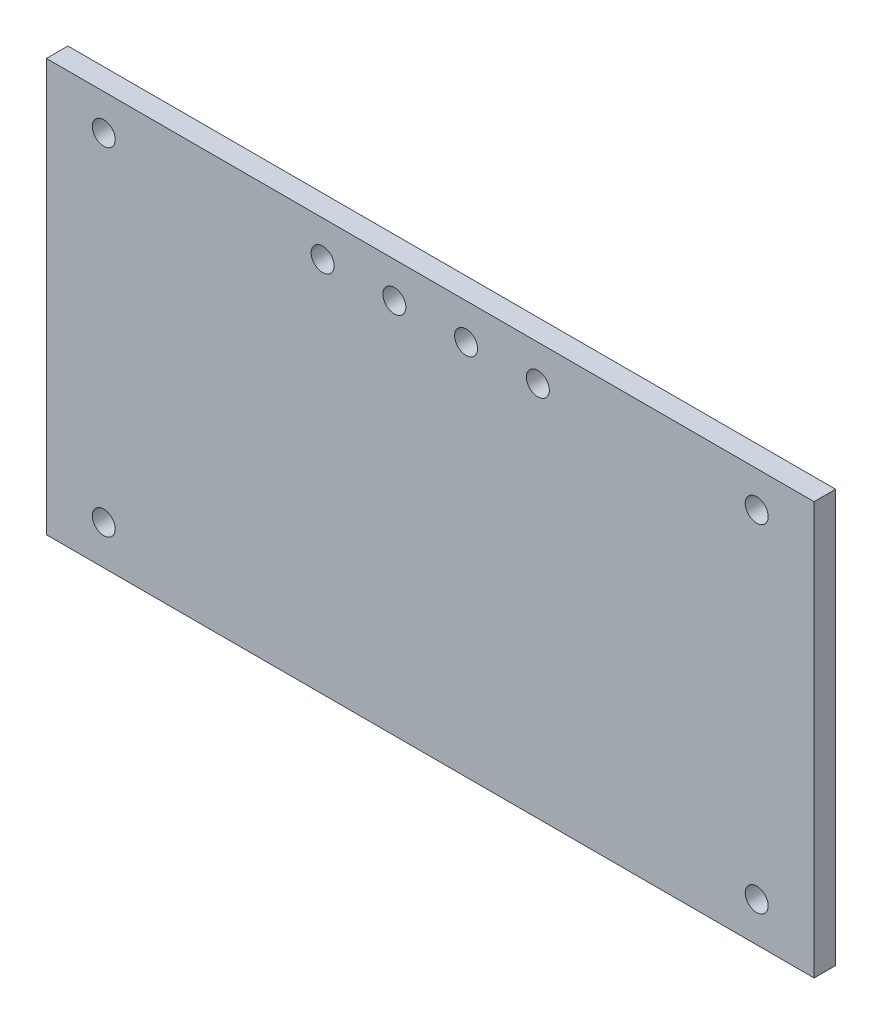
ISO-10303-21;
HEADER;
FILE_DESCRIPTION(('STEP AP214'),'2;1');
FILE_NAME('part.step','',(''),(''),'','','');
FILE_SCHEMA(('AUTOMOTIVE_DESIGN { 1 0 10303 214 1 1 1 1 }'));
ENDSEC;
DATA;
#1=APPLICATION_CONTEXT('core data for automotive mechanical design processes');
#2=APPLICATION_PROTOCOL_DEFINITION('international standard','automotive_design',2000,#1);
#3=PRODUCT_CONTEXT('',#1,'mechanical');
#4=PRODUCT('Part','Part','',(#3));
#5=PRODUCT_RELATED_PRODUCT_CATEGORY('part','',(#4));
#6=PRODUCT_DEFINITION_FORMATION('','',#4);
#7=PRODUCT_DEFINITION_CONTEXT('part definition',#1,'design');
#8=PRODUCT_DEFINITION('design','',#6,#7);
#9=PRODUCT_DEFINITION_SHAPE('','',#8);
#10=(LENGTH_UNIT() NAMED_UNIT(*) SI_UNIT(.MILLI.,.METRE.));
#11=(NAMED_UNIT(*) PLANE_ANGLE_UNIT() SI_UNIT($,.RADIAN.));
#12=(NAMED_UNIT(*) SI_UNIT($,.STERADIAN.) SOLID_ANGLE_UNIT());
#13=UNCERTAINTY_MEASURE_WITH_UNIT(LENGTH_MEASURE(1.E-05),#10,'distance_accuracy_value','');
#14=(GEOMETRIC_REPRESENTATION_CONTEXT(3) GLOBAL_UNCERTAINTY_ASSIGNED_CONTEXT((#13)) GLOBAL_UNIT_ASSIGNED_CONTEXT((#10,
#11,#12)) REPRESENTATION_CONTEXT('',''));
#15=CARTESIAN_POINT('',(0.,0.,0.));
#16=DIRECTION('',(0.,0.,1.));
#17=DIRECTION('',(1.,0.,0.));
#18=AXIS2_PLACEMENT_3D('',#15,#16,#17);
#19=CARTESIAN_POINT('',(0.,0.,3.));
#20=DIRECTION('',(0.,0.,1.));
#21=DIRECTION('',(1.,0.,0.));
#22=AXIS2_PLACEMENT_3D('',#19,#20,#21);
#23=PLANE('',#22);
#24=CARTESIAN_POINT('',(34.5759894264582,26.8307174887892,3.));
#25=DIRECTION('',(0.,0.,1.));
#26=DIRECTION('',(1.,0.,0.));
#27=AXIS2_PLACEMENT_3D('',#24,#25,#26);
#28=CIRCLE('',#27,1.6);
#29=CARTESIAN_POINT('',(36.1759894264582,26.8307174887892,3.));
#30=VERTEX_POINT('',#29);
#31=EDGE_CURVE('E178',#30,#30,#28,.T.);
#32=ORIENTED_EDGE('',*,*,#31,.F.);
#33=EDGE_LOOP('',(#32));
#34=FACE_BOUND('',#33,.T.);
#35=CARTESIAN_POINT('',(14.5759894264582,26.8307174887892,3.));
#36=DIRECTION('',(0.,0.,1.));
#37=DIRECTION('',(1.,0.,0.));
#38=AXIS2_PLACEMENT_3D('',#35,#36,#37);
#39=CIRCLE('',#38,1.6);
#40=CARTESIAN_POINT('',(16.1759894264582,26.8307174887892,3.));
#41=VERTEX_POINT('',#40);
#42=EDGE_CURVE('E162',#41,#41,#39,.T.);
#43=ORIENTED_EDGE('',*,*,#42,.F.);
#44=EDGE_LOOP('',(#43));
#45=FACE_BOUND('',#44,.T.);
#46=CARTESIAN_POINT('',(75.0759894264582,-20.1692825112108,3.));
#47=DIRECTION('',(0.,0.,1.));
#48=DIRECTION('',(1.,0.,0.));
#49=AXIS2_PLACEMENT_3D('',#46,#47,#48);
#50=CIRCLE('',#49,1.6);
#51=CARTESIAN_POINT('',(76.6759894264582,-20.1692825112108,3.));
#52=VERTEX_POINT('',#51);
#53=EDGE_CURVE('E146',#52,#52,#50,.T.);
#54=ORIENTED_EDGE('',*,*,#53,.F.);
#55=EDGE_LOOP('',(#54));
#56=FACE_BOUND('',#55,.T.);
#57=CARTESIAN_POINT('',(-15.9240105735418,26.8307174887892,3.));
#58=DIRECTION('',(0.,0.,1.));
#59=DIRECTION('',(1.,0.,0.));
#60=AXIS2_PLACEMENT_3D('',#57,#58,#59);
#61=CIRCLE('',#60,1.6);
#62=CARTESIAN_POINT('',(-14.3240105735418,26.8307174887892,3.));
#63=VERTEX_POINT('',#62);
#64=EDGE_CURVE('E116',#63,#63,#61,.T.);
#65=ORIENTED_EDGE('',*,*,#64,.F.);
#66=EDGE_LOOP('',(#65));
#67=FACE_BOUND('',#66,.T.);
#68=DIRECTION('',(0.,-1.,0.));
#69=VECTOR('',#68,1.);
#70=CARTESIAN_POINT('',(-23.9240105735418,31.8307174887892,3.));
#71=LINE('',#70,#69);
#72=CARTESIAN_POINT('',(-23.9240105735418,31.8307174887892,3.));
#73=VERTEX_POINT('',#72);
#74=CARTESIAN_POINT('',(-23.9240105735418,-25.6649428904323,3.));
#75=VERTEX_POINT('',#74);
#76=EDGE_CURVE('E96',#73,#75,#71,.T.);
#77=ORIENTED_EDGE('',*,*,#76,.T.);
#78=DIRECTION('',(1.,0.,0.));
#79=VECTOR('',#78,1.);
#80=CARTESIAN_POINT('',(-23.9240105735418,-25.6649428904323,3.));
#81=LINE('',#80,#79);
#82=CARTESIAN_POINT('',(83.0759894264582,-25.6649428904323,3.));
#83=VERTEX_POINT('',#82);
#84=EDGE_CURVE('E91',#75,#83,#81,.T.);
#85=ORIENTED_EDGE('',*,*,#84,.T.);
#86=DIRECTION('',(0.,1.,0.));
#87=VECTOR('',#86,1.);
#88=CARTESIAN_POINT('',(83.0759894264582,31.8307174887893,3.));
#89=LINE('',#88,#87);
#90=CARTESIAN_POINT('',(83.0759894264582,31.8307174887893,3.));
#91=VERTEX_POINT('',#90);
#92=EDGE_CURVE('E94',#83,#91,#89,.T.);
#93=ORIENTED_EDGE('',*,*,#92,.T.);
#94=DIRECTION('',(-1.,0.,0.));
#95=VECTOR('',#94,1.);
#96=CARTESIAN_POINT('',(-23.9240105735418,31.8307174887892,3.));
#97=LINE('',#96,#95);
#98=EDGE_CURVE('E61',#91,#73,#97,.T.);
#99=ORIENTED_EDGE('',*,*,#98,.T.);
#100=EDGE_LOOP('',(#77,#85,#93,#99));
#101=FACE_BOUND('',#100,.T.);
#102=CARTESIAN_POINT('',(-15.9240105735418,-20.1692825112108,3.));
#103=DIRECTION('',(0.,0.,1.));
#104=DIRECTION('',(1.,0.,0.));
#105=AXIS2_PLACEMENT_3D('',#102,#103,#104);
#106=CIRCLE('',#105,1.6);
#107=CARTESIAN_POINT('',(-14.3240105735418,-20.1692825112108,3.));
#108=VERTEX_POINT('',#107);
#109=EDGE_CURVE('E138',#108,#108,#106,.T.);
#110=ORIENTED_EDGE('',*,*,#109,.F.);
#111=EDGE_LOOP('',(#110));
#112=FACE_BOUND('',#111,.T.);
#113=CARTESIAN_POINT('',(75.0759894264582,26.8307174887893,3.));
#114=DIRECTION('',(0.,0.,1.));
#115=DIRECTION('',(1.,0.,0.));
#116=AXIS2_PLACEMENT_3D('',#113,#114,#115);
#117=CIRCLE('',#116,1.6);
#118=CARTESIAN_POINT('',(76.6759894264582,26.8307174887893,3.));
#119=VERTEX_POINT('',#118);
#120=EDGE_CURVE('E154',#119,#119,#117,.T.);
#121=ORIENTED_EDGE('',*,*,#120,.F.);
#122=EDGE_LOOP('',(#121));
#123=FACE_BOUND('',#122,.T.);
#124=CARTESIAN_POINT('',(24.5759894264582,26.8307174887892,3.));
#125=DIRECTION('',(0.,0.,1.));
#126=DIRECTION('',(1.,0.,0.));
#127=AXIS2_PLACEMENT_3D('',#124,#125,#126);
#128=CIRCLE('',#127,1.6);
#129=CARTESIAN_POINT('',(26.1759894264582,26.8307174887892,3.));
#130=VERTEX_POINT('',#129);
#131=EDGE_CURVE('E170',#130,#130,#128,.T.);
#132=ORIENTED_EDGE('',*,*,#131,.F.);
#133=EDGE_LOOP('',(#132));
#134=FACE_BOUND('',#133,.T.);
#135=CARTESIAN_POINT('',(44.5759894264582,26.8307174887892,3.));
#136=DIRECTION('',(0.,0.,1.));
#137=DIRECTION('',(1.,0.,0.));
#138=AXIS2_PLACEMENT_3D('',#135,#136,#137);
#139=CIRCLE('',#138,1.6);
#140=CARTESIAN_POINT('',(46.1759894264582,26.8307174887892,3.));
#141=VERTEX_POINT('',#140);
#142=EDGE_CURVE('E186',#141,#141,#139,.T.);
#143=ORIENTED_EDGE('',*,*,#142,.F.);
#144=EDGE_LOOP('',(#143));
#145=FACE_BOUND('',#144,.T.);
#146=ADVANCED_FACE('F43',(#34,#45,#56,#67,#101,#112,#123,#134,#145),#23,.T.);
#147=CARTESIAN_POINT('',(0.,0.,0.));
#148=DIRECTION('',(0.,0.,1.));
#149=DIRECTION('',(1.,0.,0.));
#150=AXIS2_PLACEMENT_3D('',#147,#148,#149);
#151=PLANE('',#150);
#152=DIRECTION('',(0.,-1.,0.));
#153=VECTOR('',#152,1.);
#154=CARTESIAN_POINT('',(-23.9240105735418,31.8307174887892,0.));
#155=LINE('',#154,#153);
#156=CARTESIAN_POINT('',(-23.9240105735418,31.8307174887892,0.));
#157=VERTEX_POINT('',#156);
#158=CARTESIAN_POINT('',(-23.9240105735418,-25.6649428904323,0.));
#159=VERTEX_POINT('',#158);
#160=EDGE_CURVE('E112',#157,#159,#155,.T.);
#161=ORIENTED_EDGE('',*,*,#160,.F.);
#162=DIRECTION('',(-1.,0.,0.));
#163=VECTOR('',#162,1.);
#164=CARTESIAN_POINT('',(-23.9240105735418,31.8307174887892,0.));
#165=LINE('',#164,#163);
#166=CARTESIAN_POINT('',(83.0759894264582,31.8307174887893,0.));
#167=VERTEX_POINT('',#166);
#168=EDGE_CURVE('E84',#167,#157,#165,.T.);
#169=ORIENTED_EDGE('',*,*,#168,.F.);
#170=DIRECTION('',(0.,1.,0.));
#171=VECTOR('',#170,1.);
#172=CARTESIAN_POINT('',(83.0759894264582,31.8307174887893,0.));
#173=LINE('',#172,#171);
#174=CARTESIAN_POINT('',(83.0759894264582,-25.6649428904323,0.));
#175=VERTEX_POINT('',#174);
#176=EDGE_CURVE('E78',#175,#167,#173,.T.);
#177=ORIENTED_EDGE('',*,*,#176,.F.);
#178=DIRECTION('',(1.,0.,0.));
#179=VECTOR('',#178,1.);
#180=CARTESIAN_POINT('',(-23.9240105735418,-25.6649428904323,0.));
#181=LINE('',#180,#179);
#182=EDGE_CURVE('E101',#159,#175,#181,.T.);
#183=ORIENTED_EDGE('',*,*,#182,.F.);
#184=EDGE_LOOP('',(#161,#169,#177,#183));
#185=FACE_BOUND('',#184,.T.);
#186=CARTESIAN_POINT('',(-15.9240105735418,26.8307174887892,0.));
#187=DIRECTION('',(0.,0.,1.));
#188=DIRECTION('',(1.,0.,0.));
#189=AXIS2_PLACEMENT_3D('',#186,#187,#188);
#190=CIRCLE('',#189,1.6);
#191=CARTESIAN_POINT('',(-14.3240105735418,26.8307174887892,0.));
#192=VERTEX_POINT('',#191);
#193=EDGE_CURVE('E134',#192,#192,#190,.T.);
#194=ORIENTED_EDGE('',*,*,#193,.T.);
#195=EDGE_LOOP('',(#194));
#196=FACE_BOUND('',#195,.T.);
#197=CARTESIAN_POINT('',(-15.9240105735418,-20.1692825112108,0.));
#198=DIRECTION('',(0.,0.,1.));
#199=DIRECTION('',(1.,0.,0.));
#200=AXIS2_PLACEMENT_3D('',#197,#198,#199);
#201=CIRCLE('',#200,1.6);
#202=CARTESIAN_POINT('',(-14.3240105735418,-20.1692825112108,0.));
#203=VERTEX_POINT('',#202);
#204=EDGE_CURVE('E142',#203,#203,#201,.T.);
#205=ORIENTED_EDGE('',*,*,#204,.T.);
#206=EDGE_LOOP('',(#205));
#207=FACE_BOUND('',#206,.T.);
#208=CARTESIAN_POINT('',(75.0759894264582,-20.1692825112108,0.));
#209=DIRECTION('',(0.,0.,1.));
#210=DIRECTION('',(1.,0.,0.));
#211=AXIS2_PLACEMENT_3D('',#208,#209,#210);
#212=CIRCLE('',#211,1.6);
#213=CARTESIAN_POINT('',(76.6759894264582,-20.1692825112108,0.));
#214=VERTEX_POINT('',#213);
#215=EDGE_CURVE('E150',#214,#214,#212,.T.);
#216=ORIENTED_EDGE('',*,*,#215,.T.);
#217=EDGE_LOOP('',(#216));
#218=FACE_BOUND('',#217,.T.);
#219=CARTESIAN_POINT('',(75.0759894264582,26.8307174887893,0.));
#220=DIRECTION('',(0.,0.,1.));
#221=DIRECTION('',(1.,0.,0.));
#222=AXIS2_PLACEMENT_3D('',#219,#220,#221);
#223=CIRCLE('',#222,1.6);
#224=CARTESIAN_POINT('',(76.6759894264582,26.8307174887893,0.));
#225=VERTEX_POINT('',#224);
#226=EDGE_CURVE('E158',#225,#225,#223,.T.);
#227=ORIENTED_EDGE('',*,*,#226,.T.);
#228=EDGE_LOOP('',(#227));
#229=FACE_BOUND('',#228,.T.);
#230=CARTESIAN_POINT('',(14.5759894264582,26.8307174887892,0.));
#231=DIRECTION('',(0.,0.,1.));
#232=DIRECTION('',(1.,0.,0.));
#233=AXIS2_PLACEMENT_3D('',#230,#231,#232);
#234=CIRCLE('',#233,1.6);
#235=CARTESIAN_POINT('',(16.1759894264582,26.8307174887892,0.));
#236=VERTEX_POINT('',#235);
#237=EDGE_CURVE('E166',#236,#236,#234,.T.);
#238=ORIENTED_EDGE('',*,*,#237,.T.);
#239=EDGE_LOOP('',(#238));
#240=FACE_BOUND('',#239,.T.);
#241=CARTESIAN_POINT('',(24.5759894264582,26.8307174887892,0.));
#242=DIRECTION('',(0.,0.,1.));
#243=DIRECTION('',(1.,0.,0.));
#244=AXIS2_PLACEMENT_3D('',#241,#242,#243);
#245=CIRCLE('',#244,1.6);
#246=CARTESIAN_POINT('',(26.1759894264582,26.8307174887892,0.));
#247=VERTEX_POINT('',#246);
#248=EDGE_CURVE('E174',#247,#247,#245,.T.);
#249=ORIENTED_EDGE('',*,*,#248,.T.);
#250=EDGE_LOOP('',(#249));
#251=FACE_BOUND('',#250,.T.);
#252=CARTESIAN_POINT('',(34.5759894264582,26.8307174887892,0.));
#253=DIRECTION('',(0.,0.,1.));
#254=DIRECTION('',(1.,0.,0.));
#255=AXIS2_PLACEMENT_3D('',#252,#253,#254);
#256=CIRCLE('',#255,1.6);
#257=CARTESIAN_POINT('',(36.1759894264582,26.8307174887892,0.));
#258=VERTEX_POINT('',#257);
#259=EDGE_CURVE('E182',#258,#258,#256,.T.);
#260=ORIENTED_EDGE('',*,*,#259,.T.);
#261=EDGE_LOOP('',(#260));
#262=FACE_BOUND('',#261,.T.);
#263=CARTESIAN_POINT('',(44.5759894264582,26.8307174887892,0.));
#264=DIRECTION('',(0.,0.,1.));
#265=DIRECTION('',(1.,0.,0.));
#266=AXIS2_PLACEMENT_3D('',#263,#264,#265);
#267=CIRCLE('',#266,1.6);
#268=CARTESIAN_POINT('',(46.1759894264582,26.8307174887892,0.));
#269=VERTEX_POINT('',#268);
#270=EDGE_CURVE('E190',#269,#269,#267,.T.);
#271=ORIENTED_EDGE('',*,*,#270,.T.);
#272=EDGE_LOOP('',(#271));
#273=FACE_BOUND('',#272,.T.);
#274=ADVANCED_FACE('F129',(#185,#196,#207,#218,#229,#240,#251,#262,#273),#151,.F.);
#275=CARTESIAN_POINT('',(-23.9240105735418,31.8307174887892,3.));
#276=DIRECTION('',(1.,0.,0.));
#277=DIRECTION('',(0.,0.,-1.));
#278=AXIS2_PLACEMENT_3D('',#275,#276,#277);
#279=PLANE('',#278);
#280=ORIENTED_EDGE('',*,*,#160,.T.);
#281=DIRECTION('',(0.,0.,-1.));
#282=VECTOR('',#281,1.);
#283=CARTESIAN_POINT('',(-23.9240105735418,-25.6649428904323,3.));
#284=LINE('',#283,#282);
#285=EDGE_CURVE('E11',#75,#159,#284,.T.);
#286=ORIENTED_EDGE('',*,*,#285,.F.);
#287=ORIENTED_EDGE('',*,*,#76,.F.);
#288=DIRECTION('',(0.,0.,-1.));
#289=VECTOR('',#288,1.);
#290=CARTESIAN_POINT('',(-23.9240105735418,31.8307174887892,3.));
#291=LINE('',#290,#289);
#292=EDGE_CURVE('E108',#73,#157,#291,.T.);
#293=ORIENTED_EDGE('',*,*,#292,.T.);
#294=EDGE_LOOP('',(#280,#286,#287,#293));
#295=FACE_BOUND('',#294,.T.);
#296=ADVANCED_FACE('F45',(#295),#279,.F.);
#297=CARTESIAN_POINT('',(-23.9240105735418,-25.6649428904323,3.));
#298=DIRECTION('',(0.,1.,0.));
#299=DIRECTION('',(0.,0.,1.));
#300=AXIS2_PLACEMENT_3D('',#297,#298,#299);
#301=PLANE('',#300);
#302=ORIENTED_EDGE('',*,*,#182,.T.);
#303=DIRECTION('',(0.,0.,-1.));
#304=VECTOR('',#303,1.);
#305=CARTESIAN_POINT('',(83.0759894264582,-25.6649428904323,3.));
#306=LINE('',#305,#304);
#307=EDGE_CURVE('E53',#83,#175,#306,.T.);
#308=ORIENTED_EDGE('',*,*,#307,.F.);
#309=ORIENTED_EDGE('',*,*,#84,.F.);
#310=ORIENTED_EDGE('',*,*,#285,.T.);
#311=EDGE_LOOP('',(#302,#308,#309,#310));
#312=FACE_BOUND('',#311,.T.);
#313=ADVANCED_FACE('F100',(#312),#301,.F.);
#314=CARTESIAN_POINT('',(83.0759894264582,31.8307174887893,3.));
#315=DIRECTION('',(-1.,0.,0.));
#316=DIRECTION('',(0.,0.,1.));
#317=AXIS2_PLACEMENT_3D('',#314,#315,#316);
#318=PLANE('',#317);
#319=ORIENTED_EDGE('',*,*,#176,.T.);
#320=DIRECTION('',(0.,0.,-1.));
#321=VECTOR('',#320,1.);
#322=CARTESIAN_POINT('',(83.0759894264582,31.8307174887893,3.));
#323=LINE('',#322,#321);
#324=EDGE_CURVE('E103',#91,#167,#323,.T.);
#325=ORIENTED_EDGE('',*,*,#324,.F.);
#326=ORIENTED_EDGE('',*,*,#92,.F.);
#327=ORIENTED_EDGE('',*,*,#307,.T.);
#328=EDGE_LOOP('',(#319,#325,#326,#327));
#329=FACE_BOUND('',#328,.T.);
#330=ADVANCED_FACE('F104',(#329),#318,.F.);
#331=CARTESIAN_POINT('',(-23.9240105735418,31.8307174887892,3.));
#332=DIRECTION('',(0.,-1.,0.));
#333=DIRECTION('',(1.,0.,0.));
#334=AXIS2_PLACEMENT_3D('',#331,#332,#333);
#335=PLANE('',#334);
#336=ORIENTED_EDGE('',*,*,#168,.T.);
#337=ORIENTED_EDGE('',*,*,#292,.F.);
#338=ORIENTED_EDGE('',*,*,#98,.F.);
#339=ORIENTED_EDGE('',*,*,#324,.T.);
#340=EDGE_LOOP('',(#336,#337,#338,#339));
#341=FACE_BOUND('',#340,.T.);
#342=ADVANCED_FACE('F126',(#341),#335,.F.);
#343=CARTESIAN_POINT('',(-15.9240105735418,26.8307174887892,3.));
#344=DIRECTION('',(0.,0.,-1.));
#345=DIRECTION('',(-1.,0.,0.));
#346=AXIS2_PLACEMENT_3D('',#343,#344,#345);
#347=CYLINDRICAL_SURFACE('',#346,1.6);
#348=ORIENTED_EDGE('',*,*,#64,.T.);
#349=EDGE_LOOP('',(#348));
#350=FACE_BOUND('',#349,.T.);
#351=ORIENTED_EDGE('',*,*,#193,.F.);
#352=EDGE_LOOP('',(#351));
#353=FACE_BOUND('',#352,.T.);
#354=ADVANCED_FACE('F211',(#350,#353),#347,.F.);
#355=CARTESIAN_POINT('',(-15.9240105735418,-20.1692825112108,3.));
#356=DIRECTION('',(0.,0.,-1.));
#357=DIRECTION('',(-1.,0.,0.));
#358=AXIS2_PLACEMENT_3D('',#355,#356,#357);
#359=CYLINDRICAL_SURFACE('',#358,1.6);
#360=ORIENTED_EDGE('',*,*,#109,.T.);
#361=EDGE_LOOP('',(#360));
#362=FACE_BOUND('',#361,.T.);
#363=ORIENTED_EDGE('',*,*,#204,.F.);
#364=EDGE_LOOP('',(#363));
#365=FACE_BOUND('',#364,.T.);
#366=ADVANCED_FACE('F265',(#362,#365),#359,.F.);
#367=CARTESIAN_POINT('',(75.0759894264582,-20.1692825112108,3.));
#368=DIRECTION('',(0.,0.,-1.));
#369=DIRECTION('',(-1.,0.,0.));
#370=AXIS2_PLACEMENT_3D('',#367,#368,#369);
#371=CYLINDRICAL_SURFACE('',#370,1.6);
#372=ORIENTED_EDGE('',*,*,#53,.T.);
#373=EDGE_LOOP('',(#372));
#374=FACE_BOUND('',#373,.T.);
#375=ORIENTED_EDGE('',*,*,#215,.F.);
#376=EDGE_LOOP('',(#375));
#377=FACE_BOUND('',#376,.T.);
#378=ADVANCED_FACE('F274',(#374,#377),#371,.F.);
#379=CARTESIAN_POINT('',(75.0759894264582,26.8307174887893,3.));
#380=DIRECTION('',(0.,0.,-1.));
#381=DIRECTION('',(-1.,0.,0.));
#382=AXIS2_PLACEMENT_3D('',#379,#380,#381);
#383=CYLINDRICAL_SURFACE('',#382,1.6);
#384=ORIENTED_EDGE('',*,*,#120,.T.);
#385=EDGE_LOOP('',(#384));
#386=FACE_BOUND('',#385,.T.);
#387=ORIENTED_EDGE('',*,*,#226,.F.);
#388=EDGE_LOOP('',(#387));
#389=FACE_BOUND('',#388,.T.);
#390=ADVANCED_FACE('F283',(#386,#389),#383,.F.);
#391=CARTESIAN_POINT('',(14.5759894264582,26.8307174887892,3.));
#392=DIRECTION('',(0.,0.,-1.));
#393=DIRECTION('',(-1.,0.,0.));
#394=AXIS2_PLACEMENT_3D('',#391,#392,#393);
#395=CYLINDRICAL_SURFACE('',#394,1.6);
#396=ORIENTED_EDGE('',*,*,#42,.T.);
#397=EDGE_LOOP('',(#396));
#398=FACE_BOUND('',#397,.T.);
#399=ORIENTED_EDGE('',*,*,#237,.F.);
#400=EDGE_LOOP('',(#399));
#401=FACE_BOUND('',#400,.T.);
#402=ADVANCED_FACE('F293',(#398,#401),#395,.F.);
#403=CARTESIAN_POINT('',(24.5759894264582,26.8307174887892,3.));
#404=DIRECTION('',(0.,0.,-1.));
#405=DIRECTION('',(-1.,0.,0.));
#406=AXIS2_PLACEMENT_3D('',#403,#404,#405);
#407=CYLINDRICAL_SURFACE('',#406,1.6);
#408=ORIENTED_EDGE('',*,*,#131,.T.);
#409=EDGE_LOOP('',(#408));
#410=FACE_BOUND('',#409,.T.);
#411=ORIENTED_EDGE('',*,*,#248,.F.);
#412=EDGE_LOOP('',(#411));
#413=FACE_BOUND('',#412,.T.);
#414=ADVANCED_FACE('F303',(#410,#413),#407,.F.);
#415=CARTESIAN_POINT('',(34.5759894264582,26.8307174887892,3.));
#416=DIRECTION('',(0.,0.,-1.));
#417=DIRECTION('',(-1.,0.,0.));
#418=AXIS2_PLACEMENT_3D('',#415,#416,#417);
#419=CYLINDRICAL_SURFACE('',#418,1.6);
#420=ORIENTED_EDGE('',*,*,#31,.T.);
#421=EDGE_LOOP('',(#420));
#422=FACE_BOUND('',#421,.T.);
#423=ORIENTED_EDGE('',*,*,#259,.F.);
#424=EDGE_LOOP('',(#423));
#425=FACE_BOUND('',#424,.T.);
#426=ADVANCED_FACE('F313',(#422,#425),#419,.F.);
#427=CARTESIAN_POINT('',(44.5759894264582,26.8307174887892,3.));
#428=DIRECTION('',(0.,0.,-1.));
#429=DIRECTION('',(-1.,0.,0.));
#430=AXIS2_PLACEMENT_3D('',#427,#428,#429);
#431=CYLINDRICAL_SURFACE('',#430,1.6);
#432=ORIENTED_EDGE('',*,*,#142,.T.);
#433=EDGE_LOOP('',(#432));
#434=FACE_BOUND('',#433,.T.);
#435=ORIENTED_EDGE('',*,*,#270,.F.);
#436=EDGE_LOOP('',(#435));
#437=FACE_BOUND('',#436,.T.);
#438=ADVANCED_FACE('F198',(#434,#437),#431,.F.);
#439=CLOSED_SHELL('',(#146,#274,#296,#313,#330,#342,#354,#366,#378,#390,#402,#414,#426,#438));
#440=MANIFOLD_SOLID_BREP('B2',#439);
#441=ADVANCED_BREP_SHAPE_REPRESENTATION('',(#18,#440),#14);
#442=SHAPE_DEFINITION_REPRESENTATION(#9,#441);
ENDSEC;
END-ISO-10303-21;
